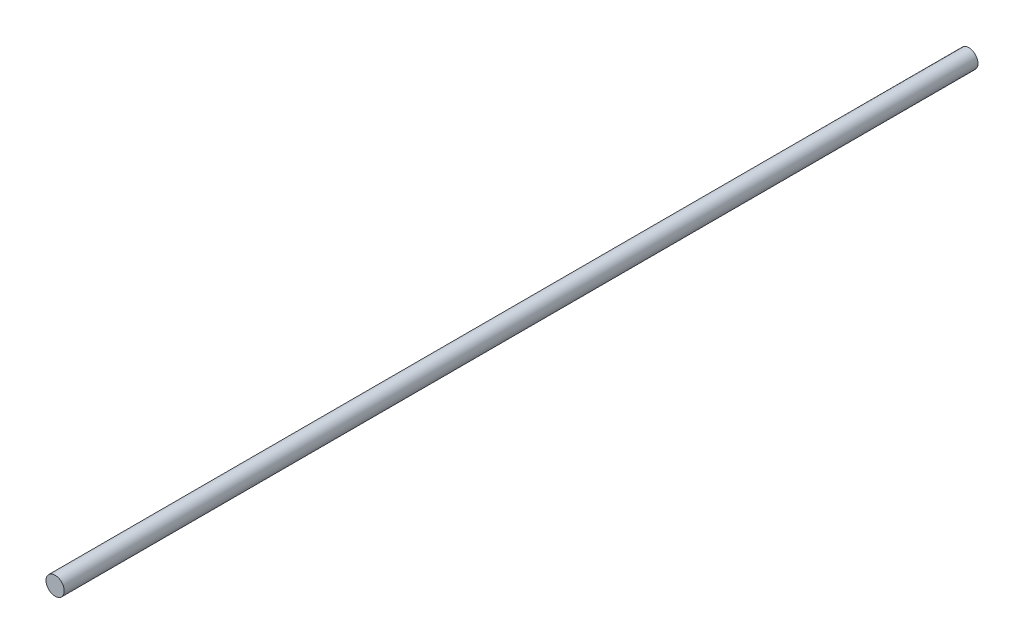
ISO-10303-21;
HEADER;
FILE_DESCRIPTION(('STEP AP214'),'2;1');
FILE_NAME('part.step','',(''),(''),'','','');
FILE_SCHEMA(('AUTOMOTIVE_DESIGN { 1 0 10303 214 1 1 1 1 }'));
ENDSEC;
DATA;
#1=APPLICATION_CONTEXT('core data for automotive mechanical design processes');
#2=APPLICATION_PROTOCOL_DEFINITION('international standard','automotive_design',2000,#1);
#3=PRODUCT_CONTEXT('',#1,'mechanical');
#4=PRODUCT('Part','Part','',(#3));
#5=PRODUCT_RELATED_PRODUCT_CATEGORY('part','',(#4));
#6=PRODUCT_DEFINITION_FORMATION('','',#4);
#7=PRODUCT_DEFINITION_CONTEXT('part definition',#1,'design');
#8=PRODUCT_DEFINITION('design','',#6,#7);
#9=PRODUCT_DEFINITION_SHAPE('','',#8);
#10=(LENGTH_UNIT() NAMED_UNIT(*) SI_UNIT(.MILLI.,.METRE.));
#11=(NAMED_UNIT(*) PLANE_ANGLE_UNIT() SI_UNIT($,.RADIAN.));
#12=(NAMED_UNIT(*) SI_UNIT($,.STERADIAN.) SOLID_ANGLE_UNIT());
#13=UNCERTAINTY_MEASURE_WITH_UNIT(LENGTH_MEASURE(1.E-05),#10,'distance_accuracy_value','');
#14=(GEOMETRIC_REPRESENTATION_CONTEXT(3) GLOBAL_UNCERTAINTY_ASSIGNED_CONTEXT((#13)) GLOBAL_UNIT_ASSIGNED_CONTEXT((#10,
#11,#12)) REPRESENTATION_CONTEXT('',''));
#15=CARTESIAN_POINT('',(0.,0.,0.));
#16=DIRECTION('',(0.,0.,1.));
#17=DIRECTION('',(1.,0.,0.));
#18=AXIS2_PLACEMENT_3D('',#15,#16,#17);
#19=CARTESIAN_POINT('',(0.,0.,400.));
#20=DIRECTION('',(0.,0.,-1.));
#21=DIRECTION('',(-1.,0.,0.));
#22=AXIS2_PLACEMENT_3D('',#19,#20,#21);
#23=CYLINDRICAL_SURFACE('',#22,4.);
#24=CARTESIAN_POINT('',(0.,0.,400.));
#25=DIRECTION('',(0.,0.,1.));
#26=DIRECTION('',(1.,0.,0.));
#27=AXIS2_PLACEMENT_3D('',#24,#25,#26);
#28=CIRCLE('',#27,4.);
#29=CARTESIAN_POINT('',(4.,0.,400.));
#30=VERTEX_POINT('',#29);
#31=EDGE_CURVE('E10',#30,#30,#28,.T.);
#32=ORIENTED_EDGE('',*,*,#31,.F.);
#33=EDGE_LOOP('',(#32));
#34=FACE_BOUND('',#33,.T.);
#35=CARTESIAN_POINT('',(0.,0.,0.));
#36=DIRECTION('',(0.,0.,1.));
#37=DIRECTION('',(1.,0.,0.));
#38=AXIS2_PLACEMENT_3D('',#35,#36,#37);
#39=CIRCLE('',#38,4.);
#40=CARTESIAN_POINT('',(4.,0.,0.));
#41=VERTEX_POINT('',#40);
#42=EDGE_CURVE('E46',#41,#41,#39,.T.);
#43=ORIENTED_EDGE('',*,*,#42,.T.);
#44=EDGE_LOOP('',(#43));
#45=FACE_BOUND('',#44,.T.);
#46=ADVANCED_FACE('F43',(#34,#45),#23,.T.);
#47=CARTESIAN_POINT('',(0.,0.,400.));
#48=DIRECTION('',(0.,0.,1.));
#49=DIRECTION('',(1.,0.,0.));
#50=AXIS2_PLACEMENT_3D('',#47,#48,#49);
#51=PLANE('',#50);
#52=ORIENTED_EDGE('',*,*,#31,.T.);
#53=EDGE_LOOP('',(#52));
#54=FACE_BOUND('',#53,.T.);
#55=ADVANCED_FACE('F60',(#54),#51,.T.);
#56=CARTESIAN_POINT('',(0.,0.,0.));
#57=DIRECTION('',(0.,0.,1.));
#58=DIRECTION('',(1.,0.,0.));
#59=AXIS2_PLACEMENT_3D('',#56,#57,#58);
#60=PLANE('',#59);
#61=ORIENTED_EDGE('',*,*,#42,.F.);
#62=EDGE_LOOP('',(#61));
#63=FACE_BOUND('',#62,.T.);
#64=ADVANCED_FACE('F58',(#63),#60,.F.);
#65=CLOSED_SHELL('',(#46,#55,#64));
#66=MANIFOLD_SOLID_BREP('B2',#65);
#67=ADVANCED_BREP_SHAPE_REPRESENTATION('',(#18,#66),#14);
#68=SHAPE_DEFINITION_REPRESENTATION(#9,#67);
ENDSEC;
END-ISO-10303-21;
